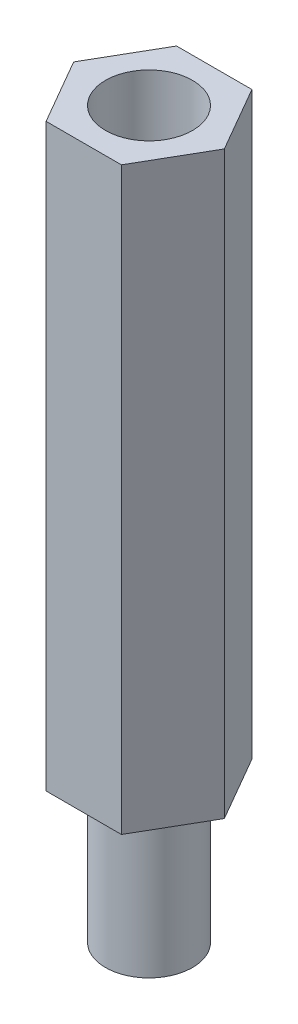
ISO-10303-21;
HEADER;
FILE_DESCRIPTION(('STEP AP214'),'2;1');
FILE_NAME('part.step','',(''),(''),'','','');
FILE_SCHEMA(('AUTOMOTIVE_DESIGN { 1 0 10303 214 1 1 1 1 }'));
ENDSEC;
DATA;
#1=APPLICATION_CONTEXT('core data for automotive mechanical design processes');
#2=APPLICATION_PROTOCOL_DEFINITION('international standard','automotive_design',2000,#1);
#3=PRODUCT_CONTEXT('',#1,'mechanical');
#4=PRODUCT('Part','Part','',(#3));
#5=PRODUCT_RELATED_PRODUCT_CATEGORY('part','',(#4));
#6=PRODUCT_DEFINITION_FORMATION('','',#4);
#7=PRODUCT_DEFINITION_CONTEXT('part definition',#1,'design');
#8=PRODUCT_DEFINITION('design','',#6,#7);
#9=PRODUCT_DEFINITION_SHAPE('','',#8);
#10=(LENGTH_UNIT() NAMED_UNIT(*) SI_UNIT(.MILLI.,.METRE.));
#11=(NAMED_UNIT(*) PLANE_ANGLE_UNIT() SI_UNIT($,.RADIAN.));
#12=(NAMED_UNIT(*) SI_UNIT($,.STERADIAN.) SOLID_ANGLE_UNIT());
#13=UNCERTAINTY_MEASURE_WITH_UNIT(LENGTH_MEASURE(1.E-05),#10,'distance_accuracy_value','');
#14=(GEOMETRIC_REPRESENTATION_CONTEXT(3) GLOBAL_UNCERTAINTY_ASSIGNED_CONTEXT((#13)) GLOBAL_UNIT_ASSIGNED_CONTEXT((#10,
#11,#12)) REPRESENTATION_CONTEXT('',''));
#15=CARTESIAN_POINT('',(0.,0.,0.));
#16=DIRECTION('',(0.,0.,1.));
#17=DIRECTION('',(1.,0.,0.));
#18=AXIS2_PLACEMENT_3D('',#15,#16,#17);
#19=CARTESIAN_POINT('',(1.29903810567666,20.,2.25));
#20=DIRECTION('',(-0.866025403784438,0.,-0.5));
#21=DIRECTION('',(-0.5,0.,0.866025403784439));
#22=AXIS2_PLACEMENT_3D('',#19,#20,#21);
#23=PLANE('',#22);
#24=DIRECTION('',(0.5,0.,-0.866025403784438));
#25=VECTOR('',#24,1.);
#26=CARTESIAN_POINT('',(1.29903810567666,0.,2.25));
#27=LINE('',#26,#25);
#28=CARTESIAN_POINT('',(1.29903810567666,0.,2.25));
#29=VERTEX_POINT('',#28);
#30=CARTESIAN_POINT('',(2.59807621135332,0.,0.));
#31=VERTEX_POINT('',#30);
#32=EDGE_CURVE('E130',#29,#31,#27,.T.);
#33=ORIENTED_EDGE('',*,*,#32,.T.);
#34=DIRECTION('',(0.,-1.,0.));
#35=VECTOR('',#34,1.);
#36=CARTESIAN_POINT('',(2.59807621135332,20.,0.));
#37=LINE('',#36,#35);
#38=CARTESIAN_POINT('',(2.59807621135332,20.,0.));
#39=VERTEX_POINT('',#38);
#40=EDGE_CURVE('E42',#39,#31,#37,.T.);
#41=ORIENTED_EDGE('',*,*,#40,.F.);
#42=DIRECTION('',(0.5,0.,-0.866025403784438));
#43=VECTOR('',#42,1.);
#44=CARTESIAN_POINT('',(1.29903810567666,20.,2.25));
#45=LINE('',#44,#43);
#46=CARTESIAN_POINT('',(1.29903810567666,20.,2.25));
#47=VERTEX_POINT('',#46);
#48=EDGE_CURVE('E147',#47,#39,#45,.T.);
#49=ORIENTED_EDGE('',*,*,#48,.F.);
#50=DIRECTION('',(0.,-1.,0.));
#51=VECTOR('',#50,1.);
#52=CARTESIAN_POINT('',(1.29903810567666,20.,2.25));
#53=LINE('',#52,#51);
#54=EDGE_CURVE('E126',#47,#29,#53,.T.);
#55=ORIENTED_EDGE('',*,*,#54,.T.);
#56=EDGE_LOOP('',(#33,#41,#49,#55));
#57=FACE_BOUND('',#56,.T.);
#58=ADVANCED_FACE('F39',(#57),#23,.F.);
#59=CARTESIAN_POINT('',(2.59807621135332,20.,0.));
#60=DIRECTION('',(-0.866025403784439,0.,0.5));
#61=DIRECTION('',(0.5,0.,0.866025403784439));
#62=AXIS2_PLACEMENT_3D('',#59,#60,#61);
#63=PLANE('',#62);
#64=DIRECTION('',(-0.5,0.,-0.866025403784439));
#65=VECTOR('',#64,1.);
#66=CARTESIAN_POINT('',(2.59807621135332,0.,0.));
#67=LINE('',#66,#65);
#68=CARTESIAN_POINT('',(1.29903810567666,0.,-2.25));
#69=VERTEX_POINT('',#68);
#70=EDGE_CURVE('E134',#31,#69,#67,.T.);
#71=ORIENTED_EDGE('',*,*,#70,.T.);
#72=DIRECTION('',(0.,-1.,0.));
#73=VECTOR('',#72,1.);
#74=CARTESIAN_POINT('',(1.29903810567666,20.,-2.25));
#75=LINE('',#74,#73);
#76=CARTESIAN_POINT('',(1.29903810567666,20.,-2.25));
#77=VERTEX_POINT('',#76);
#78=EDGE_CURVE('E153',#77,#69,#75,.T.);
#79=ORIENTED_EDGE('',*,*,#78,.F.);
#80=DIRECTION('',(-0.5,0.,-0.866025403784439));
#81=VECTOR('',#80,1.);
#82=CARTESIAN_POINT('',(2.59807621135332,20.,0.));
#83=LINE('',#82,#81);
#84=EDGE_CURVE('E95',#39,#77,#83,.T.);
#85=ORIENTED_EDGE('',*,*,#84,.F.);
#86=ORIENTED_EDGE('',*,*,#40,.T.);
#87=EDGE_LOOP('',(#71,#79,#85,#86));
#88=FACE_BOUND('',#87,.T.);
#89=ADVANCED_FACE('F160',(#88),#63,.F.);
#90=CARTESIAN_POINT('',(1.29903810567666,20.,-2.25));
#91=DIRECTION('',(0.,0.,1.));
#92=DIRECTION('',(1.,0.,0.));
#93=AXIS2_PLACEMENT_3D('',#90,#91,#92);
#94=PLANE('',#93);
#95=DIRECTION('',(-1.,0.,0.));
#96=VECTOR('',#95,1.);
#97=CARTESIAN_POINT('',(1.29903810567666,0.,-2.25));
#98=LINE('',#97,#96);
#99=CARTESIAN_POINT('',(-1.29903810567666,0.,-2.25));
#100=VERTEX_POINT('',#99);
#101=EDGE_CURVE('E138',#69,#100,#98,.T.);
#102=ORIENTED_EDGE('',*,*,#101,.T.);
#103=DIRECTION('',(0.,-1.,0.));
#104=VECTOR('',#103,1.);
#105=CARTESIAN_POINT('',(-1.29903810567666,20.,-2.25));
#106=LINE('',#105,#104);
#107=CARTESIAN_POINT('',(-1.29903810567666,20.,-2.25));
#108=VERTEX_POINT('',#107);
#109=EDGE_CURVE('E119',#108,#100,#106,.T.);
#110=ORIENTED_EDGE('',*,*,#109,.F.);
#111=DIRECTION('',(-1.,0.,0.));
#112=VECTOR('',#111,1.);
#113=CARTESIAN_POINT('',(1.29903810567666,20.,-2.25));
#114=LINE('',#113,#112);
#115=EDGE_CURVE('E108',#77,#108,#114,.T.);
#116=ORIENTED_EDGE('',*,*,#115,.F.);
#117=ORIENTED_EDGE('',*,*,#78,.T.);
#118=EDGE_LOOP('',(#102,#110,#116,#117));
#119=FACE_BOUND('',#118,.T.);
#120=ADVANCED_FACE('F166',(#119),#94,.F.);
#121=CARTESIAN_POINT('',(-1.29903810567666,20.,-2.25));
#122=DIRECTION('',(0.866025403784438,0.,0.5));
#123=DIRECTION('',(0.5,0.,-0.866025403784439));
#124=AXIS2_PLACEMENT_3D('',#121,#122,#123);
#125=PLANE('',#124);
#126=DIRECTION('',(-0.5,0.,0.866025403784438));
#127=VECTOR('',#126,1.);
#128=CARTESIAN_POINT('',(-1.29903810567666,0.,-2.25));
#129=LINE('',#128,#127);
#130=CARTESIAN_POINT('',(-2.59807621135332,0.,0.));
#131=VERTEX_POINT('',#130);
#132=EDGE_CURVE('E117',#100,#131,#129,.T.);
#133=ORIENTED_EDGE('',*,*,#132,.T.);
#134=DIRECTION('',(0.,-1.,0.));
#135=VECTOR('',#134,1.);
#136=CARTESIAN_POINT('',(-2.59807621135332,20.,0.));
#137=LINE('',#136,#135);
#138=CARTESIAN_POINT('',(-2.59807621135332,20.,0.));
#139=VERTEX_POINT('',#138);
#140=EDGE_CURVE('E114',#139,#131,#137,.T.);
#141=ORIENTED_EDGE('',*,*,#140,.F.);
#142=DIRECTION('',(-0.5,0.,0.866025403784438));
#143=VECTOR('',#142,1.);
#144=CARTESIAN_POINT('',(-1.29903810567666,20.,-2.25));
#145=LINE('',#144,#143);
#146=EDGE_CURVE('E102',#108,#139,#145,.T.);
#147=ORIENTED_EDGE('',*,*,#146,.F.);
#148=ORIENTED_EDGE('',*,*,#109,.T.);
#149=EDGE_LOOP('',(#133,#141,#147,#148));
#150=FACE_BOUND('',#149,.T.);
#151=ADVANCED_FACE('F115',(#150),#125,.F.);
#152=CARTESIAN_POINT('',(-2.59807621135332,20.,0.));
#153=DIRECTION('',(0.866025403784439,0.,-0.5));
#154=DIRECTION('',(-0.5,0.,-0.866025403784439));
#155=AXIS2_PLACEMENT_3D('',#152,#153,#154);
#156=PLANE('',#155);
#157=DIRECTION('',(0.5,0.,0.866025403784439));
#158=VECTOR('',#157,1.);
#159=CARTESIAN_POINT('',(-2.59807621135332,0.,0.));
#160=LINE('',#159,#158);
#161=CARTESIAN_POINT('',(-1.29903810567666,0.,2.25));
#162=VERTEX_POINT('',#161);
#163=EDGE_CURVE('E80',#131,#162,#160,.T.);
#164=ORIENTED_EDGE('',*,*,#163,.T.);
#165=DIRECTION('',(0.,-1.,0.));
#166=VECTOR('',#165,1.);
#167=CARTESIAN_POINT('',(-1.29903810567666,20.,2.25));
#168=LINE('',#167,#166);
#169=CARTESIAN_POINT('',(-1.29903810567666,20.,2.25));
#170=VERTEX_POINT('',#169);
#171=EDGE_CURVE('E120',#170,#162,#168,.T.);
#172=ORIENTED_EDGE('',*,*,#171,.F.);
#173=DIRECTION('',(0.5,0.,0.866025403784439));
#174=VECTOR('',#173,1.);
#175=CARTESIAN_POINT('',(-2.59807621135332,20.,0.));
#176=LINE('',#175,#174);
#177=EDGE_CURVE('E106',#139,#170,#176,.T.);
#178=ORIENTED_EDGE('',*,*,#177,.F.);
#179=ORIENTED_EDGE('',*,*,#140,.T.);
#180=EDGE_LOOP('',(#164,#172,#178,#179));
#181=FACE_BOUND('',#180,.T.);
#182=ADVANCED_FACE('F122',(#181),#156,.F.);
#183=CARTESIAN_POINT('',(-1.29903810567666,20.,2.25));
#184=DIRECTION('',(0.,0.,-1.));
#185=DIRECTION('',(-1.,0.,0.));
#186=AXIS2_PLACEMENT_3D('',#183,#184,#185);
#187=PLANE('',#186);
#188=DIRECTION('',(1.,0.,0.));
#189=VECTOR('',#188,1.);
#190=CARTESIAN_POINT('',(-1.29903810567666,0.,2.25));
#191=LINE('',#190,#189);
#192=EDGE_CURVE('E86',#162,#29,#191,.T.);
#193=ORIENTED_EDGE('',*,*,#192,.T.);
#194=ORIENTED_EDGE('',*,*,#54,.F.);
#195=DIRECTION('',(1.,0.,0.));
#196=VECTOR('',#195,1.);
#197=CARTESIAN_POINT('',(-1.29903810567666,20.,2.25));
#198=LINE('',#197,#196);
#199=EDGE_CURVE('E57',#170,#47,#198,.T.);
#200=ORIENTED_EDGE('',*,*,#199,.F.);
#201=ORIENTED_EDGE('',*,*,#171,.T.);
#202=EDGE_LOOP('',(#193,#194,#200,#201));
#203=FACE_BOUND('',#202,.T.);
#204=ADVANCED_FACE('F195',(#203),#187,.F.);
#205=CARTESIAN_POINT('',(0.,20.,0.));
#206=DIRECTION('',(0.,1.,0.));
#207=DIRECTION('',(0.,0.,1.));
#208=AXIS2_PLACEMENT_3D('',#205,#206,#207);
#209=PLANE('',#208);
#210=CARTESIAN_POINT('',(0.,20.,0.));
#211=DIRECTION('',(0.,1.,0.));
#212=DIRECTION('',(0.,0.,1.));
#213=AXIS2_PLACEMENT_3D('',#210,#211,#212);
#214=CIRCLE('',#213,1.5);
#215=CARTESIAN_POINT('',(0.,20.,1.5));
#216=VERTEX_POINT('',#215);
#217=EDGE_CURVE('E177',#216,#216,#214,.T.);
#218=ORIENTED_EDGE('',*,*,#217,.F.);
#219=EDGE_LOOP('',(#218));
#220=FACE_BOUND('',#219,.T.);
#221=ORIENTED_EDGE('',*,*,#48,.T.);
#222=ORIENTED_EDGE('',*,*,#84,.T.);
#223=ORIENTED_EDGE('',*,*,#115,.T.);
#224=ORIENTED_EDGE('',*,*,#146,.T.);
#225=ORIENTED_EDGE('',*,*,#177,.T.);
#226=ORIENTED_EDGE('',*,*,#199,.T.);
#227=EDGE_LOOP('',(#221,#222,#223,#224,#225,#226));
#228=FACE_BOUND('',#227,.T.);
#229=ADVANCED_FACE('F104',(#220,#228),#209,.T.);
#230=CARTESIAN_POINT('',(0.,0.,0.));
#231=DIRECTION('',(0.,1.,0.));
#232=DIRECTION('',(0.,0.,1.));
#233=AXIS2_PLACEMENT_3D('',#230,#231,#232);
#234=PLANE('',#233);
#235=CARTESIAN_POINT('',(0.,0.,0.));
#236=DIRECTION('',(0.,-1.,0.));
#237=DIRECTION('',(0.,0.,-1.));
#238=AXIS2_PLACEMENT_3D('',#235,#236,#237);
#239=CIRCLE('',#238,1.5);
#240=CARTESIAN_POINT('',(0.,0.,-1.5));
#241=VERTEX_POINT('',#240);
#242=EDGE_CURVE('E11',#241,#241,#239,.T.);
#243=ORIENTED_EDGE('',*,*,#242,.F.);
#244=EDGE_LOOP('',(#243));
#245=FACE_BOUND('',#244,.T.);
#246=ORIENTED_EDGE('',*,*,#32,.F.);
#247=ORIENTED_EDGE('',*,*,#192,.F.);
#248=ORIENTED_EDGE('',*,*,#163,.F.);
#249=ORIENTED_EDGE('',*,*,#132,.F.);
#250=ORIENTED_EDGE('',*,*,#101,.F.);
#251=ORIENTED_EDGE('',*,*,#70,.F.);
#252=EDGE_LOOP('',(#246,#247,#248,#249,#250,#251));
#253=FACE_BOUND('',#252,.T.);
#254=ADVANCED_FACE('F165',(#245,#253),#234,.F.);
#255=CARTESIAN_POINT('',(0.,-5.,0.));
#256=DIRECTION('',(0.,1.,0.));
#257=DIRECTION('',(0.,0.,1.));
#258=AXIS2_PLACEMENT_3D('',#255,#256,#257);
#259=CYLINDRICAL_SURFACE('',#258,1.5);
#260=CARTESIAN_POINT('',(0.,-5.,0.));
#261=DIRECTION('',(0.,-1.,0.));
#262=DIRECTION('',(0.,0.,-1.));
#263=AXIS2_PLACEMENT_3D('',#260,#261,#262);
#264=CIRCLE('',#263,1.5);
#265=CARTESIAN_POINT('',(0.,-5.,-1.5));
#266=VERTEX_POINT('',#265);
#267=EDGE_CURVE('E135',#266,#266,#264,.T.);
#268=ORIENTED_EDGE('',*,*,#267,.F.);
#269=EDGE_LOOP('',(#268));
#270=FACE_BOUND('',#269,.T.);
#271=ORIENTED_EDGE('',*,*,#242,.T.);
#272=EDGE_LOOP('',(#271));
#273=FACE_BOUND('',#272,.T.);
#274=ADVANCED_FACE('F201',(#270,#273),#259,.T.);
#275=CARTESIAN_POINT('',(0.,-5.,0.));
#276=DIRECTION('',(0.,-1.,0.));
#277=DIRECTION('',(0.,0.,-1.));
#278=AXIS2_PLACEMENT_3D('',#275,#276,#277);
#279=PLANE('',#278);
#280=ORIENTED_EDGE('',*,*,#267,.T.);
#281=EDGE_LOOP('',(#280));
#282=FACE_BOUND('',#281,.T.);
#283=ADVANCED_FACE('F190',(#282),#279,.T.);
#284=CARTESIAN_POINT('',(0.,15.,0.));
#285=DIRECTION('',(0.,1.,0.));
#286=DIRECTION('',(0.,0.,1.));
#287=AXIS2_PLACEMENT_3D('',#284,#285,#286);
#288=CYLINDRICAL_SURFACE('',#287,1.5);
#289=CARTESIAN_POINT('',(0.,15.,0.));
#290=DIRECTION('',(0.,1.,0.));
#291=DIRECTION('',(0.,0.,1.));
#292=AXIS2_PLACEMENT_3D('',#289,#290,#291);
#293=CIRCLE('',#292,1.5);
#294=CARTESIAN_POINT('',(0.,15.,1.5));
#295=VERTEX_POINT('',#294);
#296=EDGE_CURVE('E176',#295,#295,#293,.T.);
#297=ORIENTED_EDGE('',*,*,#296,.F.);
#298=EDGE_LOOP('',(#297));
#299=FACE_BOUND('',#298,.T.);
#300=ORIENTED_EDGE('',*,*,#217,.T.);
#301=EDGE_LOOP('',(#300));
#302=FACE_BOUND('',#301,.T.);
#303=ADVANCED_FACE('F187',(#299,#302),#288,.F.);
#304=CARTESIAN_POINT('',(0.,15.,0.));
#305=DIRECTION('',(0.,1.,0.));
#306=DIRECTION('',(0.,0.,1.));
#307=AXIS2_PLACEMENT_3D('',#304,#305,#306);
#308=PLANE('',#307);
#309=ORIENTED_EDGE('',*,*,#296,.T.);
#310=EDGE_LOOP('',(#309));
#311=FACE_BOUND('',#310,.T.);
#312=ADVANCED_FACE('F185',(#311),#308,.T.);
#313=CLOSED_SHELL('',(#58,#89,#120,#151,#182,#204,#229,#254,#274,#283,#303,#312));
#314=MANIFOLD_SOLID_BREP('B2',#313);
#315=ADVANCED_BREP_SHAPE_REPRESENTATION('',(#18,#314),#14);
#316=SHAPE_DEFINITION_REPRESENTATION(#9,#315);
ENDSEC;
END-ISO-10303-21;
